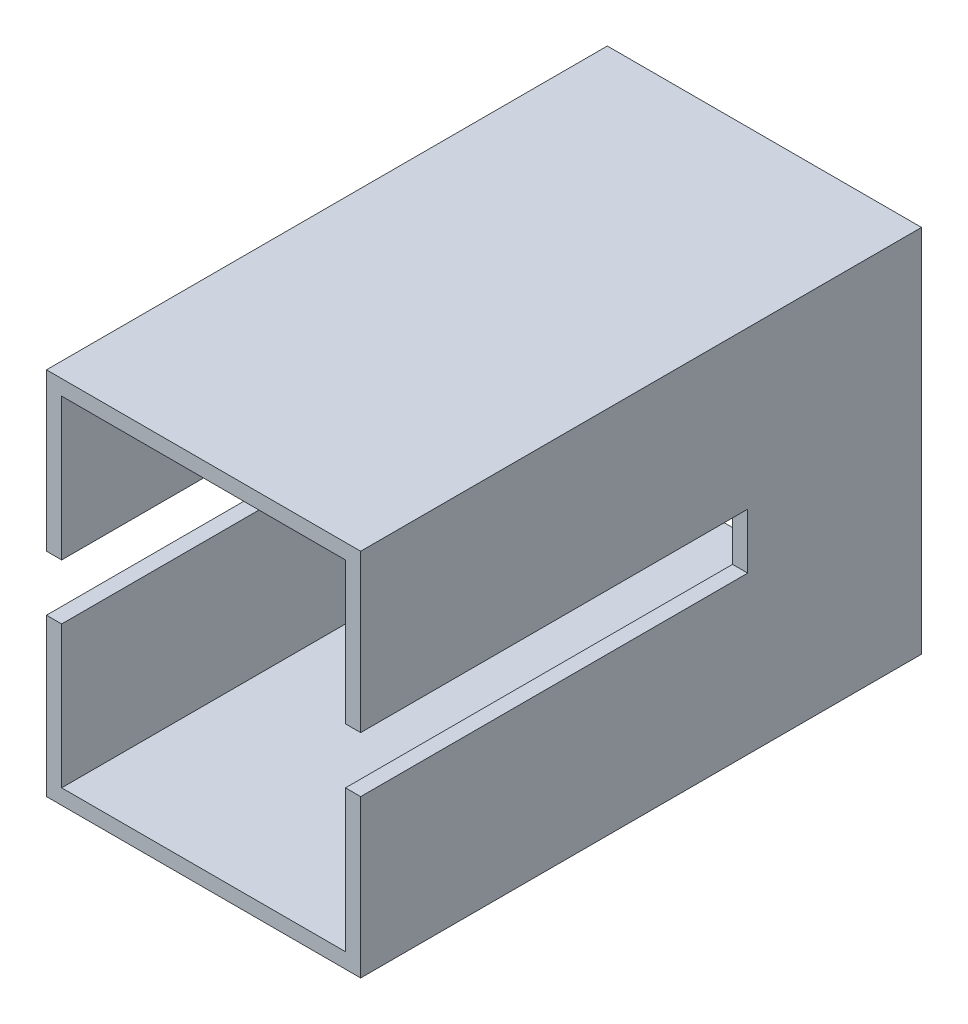
ISO-10303-21;
HEADER;
FILE_DESCRIPTION(('STEP AP214'),'2;1');
FILE_NAME('part.step','',(''),(''),'','','');
FILE_SCHEMA(('AUTOMOTIVE_DESIGN { 1 0 10303 214 1 1 1 1 }'));
ENDSEC;
DATA;
#1=APPLICATION_CONTEXT('core data for automotive mechanical design processes');
#2=APPLICATION_PROTOCOL_DEFINITION('international standard','automotive_design',2000,#1);
#3=PRODUCT_CONTEXT('',#1,'mechanical');
#4=PRODUCT('Part','Part','',(#3));
#5=PRODUCT_RELATED_PRODUCT_CATEGORY('part','',(#4));
#6=PRODUCT_DEFINITION_FORMATION('','',#4);
#7=PRODUCT_DEFINITION_CONTEXT('part definition',#1,'design');
#8=PRODUCT_DEFINITION('design','',#6,#7);
#9=PRODUCT_DEFINITION_SHAPE('','',#8);
#10=(LENGTH_UNIT() NAMED_UNIT(*) SI_UNIT(.MILLI.,.METRE.));
#11=(NAMED_UNIT(*) PLANE_ANGLE_UNIT() SI_UNIT($,.RADIAN.));
#12=(NAMED_UNIT(*) SI_UNIT($,.STERADIAN.) SOLID_ANGLE_UNIT());
#13=UNCERTAINTY_MEASURE_WITH_UNIT(LENGTH_MEASURE(1.E-05),#10,'distance_accuracy_value','');
#14=(GEOMETRIC_REPRESENTATION_CONTEXT(3) GLOBAL_UNCERTAINTY_ASSIGNED_CONTEXT((#13)) GLOBAL_UNIT_ASSIGNED_CONTEXT((#10,
#11,#12)) REPRESENTATION_CONTEXT('',''));
#15=CARTESIAN_POINT('',(0.,0.,0.));
#16=DIRECTION('',(0.,0.,1.));
#17=DIRECTION('',(1.,0.,0.));
#18=AXIS2_PLACEMENT_3D('',#15,#16,#17);
#19=CARTESIAN_POINT('',(0.,0.,36.95));
#20=DIRECTION('',(0.,0.,1.));
#21=DIRECTION('',(1.,0.,0.));
#22=AXIS2_PLACEMENT_3D('',#19,#20,#21);
#23=PLANE('',#22);
#24=DIRECTION('',(-1.,0.,0.));
#25=VECTOR('',#24,1.);
#26=CARTESIAN_POINT('',(10.35,-1.825,36.95));
#27=LINE('',#26,#25);
#28=CARTESIAN_POINT('',(-9.35,-1.825,36.95));
#29=VERTEX_POINT('',#28);
#30=CARTESIAN_POINT('',(-10.35,-1.825,36.95));
#31=VERTEX_POINT('',#30);
#32=EDGE_CURVE('E353',#29,#31,#27,.T.);
#33=ORIENTED_EDGE('',*,*,#32,.T.);
#34=DIRECTION('',(0.,-1.,0.));
#35=VECTOR('',#34,1.);
#36=CARTESIAN_POINT('',(-10.35,11.175,36.95));
#37=LINE('',#36,#35);
#38=CARTESIAN_POINT('',(-10.35,-12.175,36.95));
#39=VERTEX_POINT('',#38);
#40=EDGE_CURVE('E222',#31,#39,#37,.T.);
#41=ORIENTED_EDGE('',*,*,#40,.T.);
#42=DIRECTION('',(1.,0.,0.));
#43=VECTOR('',#42,1.);
#44=CARTESIAN_POINT('',(-9.35,-12.175,36.95));
#45=LINE('',#44,#43);
#46=CARTESIAN_POINT('',(10.35,-12.175,36.95));
#47=VERTEX_POINT('',#46);
#48=EDGE_CURVE('E227',#39,#47,#45,.T.);
#49=ORIENTED_EDGE('',*,*,#48,.T.);
#50=DIRECTION('',(0.,1.,0.));
#51=VECTOR('',#50,1.);
#52=CARTESIAN_POINT('',(10.35,11.175,36.95));
#53=LINE('',#52,#51);
#54=CARTESIAN_POINT('',(10.35,-1.825,36.95));
#55=VERTEX_POINT('',#54);
#56=EDGE_CURVE('E207',#47,#55,#53,.T.);
#57=ORIENTED_EDGE('',*,*,#56,.T.);
#58=CARTESIAN_POINT('',(9.35,-1.825,36.95));
#59=VERTEX_POINT('',#58);
#60=EDGE_CURVE('E285',#55,#59,#27,.T.);
#61=ORIENTED_EDGE('',*,*,#60,.T.);
#62=DIRECTION('',(0.,1.,0.));
#63=VECTOR('',#62,1.);
#64=CARTESIAN_POINT('',(9.35,11.175,36.95));
#65=LINE('',#64,#63);
#66=CARTESIAN_POINT('',(9.35,-11.175,36.95));
#67=VERTEX_POINT('',#66);
#68=EDGE_CURVE('E292',#67,#59,#65,.T.);
#69=ORIENTED_EDGE('',*,*,#68,.F.);
#70=DIRECTION('',(1.,0.,0.));
#71=VECTOR('',#70,1.);
#72=CARTESIAN_POINT('',(-9.35,-11.175,36.95));
#73=LINE('',#72,#71);
#74=CARTESIAN_POINT('',(-9.35,-11.175,36.95));
#75=VERTEX_POINT('',#74);
#76=EDGE_CURVE('E302',#75,#67,#73,.T.);
#77=ORIENTED_EDGE('',*,*,#76,.F.);
#78=DIRECTION('',(0.,-1.,0.));
#79=VECTOR('',#78,1.);
#80=CARTESIAN_POINT('',(-9.35,11.175,36.95));
#81=LINE('',#80,#79);
#82=EDGE_CURVE('E299',#29,#75,#81,.T.);
#83=ORIENTED_EDGE('',*,*,#82,.F.);
#84=EDGE_LOOP('',(#33,#41,#49,#57,#61,#69,#77,#83));
#85=FACE_BOUND('',#84,.T.);
#86=ADVANCED_FACE('F69',(#85),#23,.T.);
#87=DIRECTION('',(-1.,0.,0.));
#88=VECTOR('',#87,1.);
#89=CARTESIAN_POINT('',(10.35,1.825,36.95));
#90=LINE('',#89,#88);
#91=CARTESIAN_POINT('',(10.35,1.825,36.95));
#92=VERTEX_POINT('',#91);
#93=CARTESIAN_POINT('',(9.35,1.825,36.95));
#94=VERTEX_POINT('',#93);
#95=EDGE_CURVE('E85',#92,#94,#90,.T.);
#96=ORIENTED_EDGE('',*,*,#95,.F.);
#97=CARTESIAN_POINT('',(10.35,12.175,36.95));
#98=VERTEX_POINT('',#97);
#99=EDGE_CURVE('E195',#92,#98,#53,.T.);
#100=ORIENTED_EDGE('',*,*,#99,.T.);
#101=DIRECTION('',(-1.,0.,0.));
#102=VECTOR('',#101,1.);
#103=CARTESIAN_POINT('',(-9.35,12.175,36.95));
#104=LINE('',#103,#102);
#105=CARTESIAN_POINT('',(-10.35,12.175,36.95));
#106=VERTEX_POINT('',#105);
#107=EDGE_CURVE('E213',#98,#106,#104,.T.);
#108=ORIENTED_EDGE('',*,*,#107,.T.);
#109=CARTESIAN_POINT('',(-10.35,1.825,36.95));
#110=VERTEX_POINT('',#109);
#111=EDGE_CURVE('E223',#106,#110,#37,.T.);
#112=ORIENTED_EDGE('',*,*,#111,.T.);
#113=CARTESIAN_POINT('',(-9.35,1.825,36.95));
#114=VERTEX_POINT('',#113);
#115=EDGE_CURVE('E200',#114,#110,#90,.T.);
#116=ORIENTED_EDGE('',*,*,#115,.F.);
#117=CARTESIAN_POINT('',(-9.35,11.175,36.95));
#118=VERTEX_POINT('',#117);
#119=EDGE_CURVE('E268',#118,#114,#81,.T.);
#120=ORIENTED_EDGE('',*,*,#119,.F.);
#121=DIRECTION('',(-1.,0.,0.));
#122=VECTOR('',#121,1.);
#123=CARTESIAN_POINT('',(-9.35,11.175,36.95));
#124=LINE('',#123,#122);
#125=CARTESIAN_POINT('',(9.35,11.175,36.95));
#126=VERTEX_POINT('',#125);
#127=EDGE_CURVE('E296',#126,#118,#124,.T.);
#128=ORIENTED_EDGE('',*,*,#127,.F.);
#129=EDGE_CURVE('E198',#94,#126,#65,.T.);
#130=ORIENTED_EDGE('',*,*,#129,.F.);
#131=EDGE_LOOP('',(#96,#100,#108,#112,#116,#120,#128,#130));
#132=FACE_BOUND('',#131,.T.);
#133=ADVANCED_FACE('F194',(#132),#23,.T.);
#134=CARTESIAN_POINT('',(0.,0.,0.));
#135=DIRECTION('',(0.,0.,1.));
#136=DIRECTION('',(1.,0.,0.));
#137=AXIS2_PLACEMENT_3D('',#134,#135,#136);
#138=PLANE('',#137);
#139=DIRECTION('',(0.,1.,0.));
#140=VECTOR('',#139,1.);
#141=CARTESIAN_POINT('',(10.35,11.175,0.));
#142=LINE('',#141,#140);
#143=CARTESIAN_POINT('',(10.35,-12.175,0.));
#144=VERTEX_POINT('',#143);
#145=CARTESIAN_POINT('',(10.35,12.175,0.));
#146=VERTEX_POINT('',#145);
#147=EDGE_CURVE('E231',#144,#146,#142,.T.);
#148=ORIENTED_EDGE('',*,*,#147,.F.);
#149=DIRECTION('',(1.,0.,0.));
#150=VECTOR('',#149,1.);
#151=CARTESIAN_POINT('',(-9.35,-12.175,0.));
#152=LINE('',#151,#150);
#153=CARTESIAN_POINT('',(-10.35,-12.175,0.));
#154=VERTEX_POINT('',#153);
#155=EDGE_CURVE('E208',#154,#144,#152,.T.);
#156=ORIENTED_EDGE('',*,*,#155,.F.);
#157=DIRECTION('',(0.,-1.,0.));
#158=VECTOR('',#157,1.);
#159=CARTESIAN_POINT('',(-10.35,11.175,0.));
#160=LINE('',#159,#158);
#161=CARTESIAN_POINT('',(-10.35,12.175,0.));
#162=VERTEX_POINT('',#161);
#163=EDGE_CURVE('E214',#162,#154,#160,.T.);
#164=ORIENTED_EDGE('',*,*,#163,.F.);
#165=DIRECTION('',(-1.,0.,0.));
#166=VECTOR('',#165,1.);
#167=CARTESIAN_POINT('',(-9.35,12.175,0.));
#168=LINE('',#167,#166);
#169=EDGE_CURVE('E234',#146,#162,#168,.T.);
#170=ORIENTED_EDGE('',*,*,#169,.F.);
#171=EDGE_LOOP('',(#148,#156,#164,#170));
#172=FACE_BOUND('',#171,.T.);
#173=DIRECTION('',(0.,1.,0.));
#174=VECTOR('',#173,1.);
#175=CARTESIAN_POINT('',(9.35,11.175,0.));
#176=LINE('',#175,#174);
#177=CARTESIAN_POINT('',(9.35,-11.175,0.));
#178=VERTEX_POINT('',#177);
#179=CARTESIAN_POINT('',(9.35,11.175,0.));
#180=VERTEX_POINT('',#179);
#181=EDGE_CURVE('E291',#178,#180,#176,.T.);
#182=ORIENTED_EDGE('',*,*,#181,.T.);
#183=DIRECTION('',(-1.,0.,0.));
#184=VECTOR('',#183,1.);
#185=CARTESIAN_POINT('',(-9.35,11.175,0.));
#186=LINE('',#185,#184);
#187=CARTESIAN_POINT('',(-9.35,11.175,0.));
#188=VERTEX_POINT('',#187);
#189=EDGE_CURVE('E309',#180,#188,#186,.T.);
#190=ORIENTED_EDGE('',*,*,#189,.T.);
#191=DIRECTION('',(0.,-1.,0.));
#192=VECTOR('',#191,1.);
#193=CARTESIAN_POINT('',(-9.35,11.175,0.));
#194=LINE('',#193,#192);
#195=CARTESIAN_POINT('',(-9.35,-11.175,0.));
#196=VERTEX_POINT('',#195);
#197=EDGE_CURVE('E313',#188,#196,#194,.T.);
#198=ORIENTED_EDGE('',*,*,#197,.T.);
#199=DIRECTION('',(1.,0.,0.));
#200=VECTOR('',#199,1.);
#201=CARTESIAN_POINT('',(-9.35,-11.175,0.));
#202=LINE('',#201,#200);
#203=EDGE_CURVE('E317',#196,#178,#202,.T.);
#204=ORIENTED_EDGE('',*,*,#203,.T.);
#205=EDGE_LOOP('',(#182,#190,#198,#204));
#206=FACE_BOUND('',#205,.T.);
#207=ADVANCED_FACE('F338',(#172,#206),#138,.F.);
#208=CARTESIAN_POINT('',(10.35,11.175,36.95));
#209=DIRECTION('',(-1.,0.,0.));
#210=DIRECTION('',(0.,-1.,0.));
#211=AXIS2_PLACEMENT_3D('',#208,#209,#210);
#212=PLANE('',#211);
#213=DIRECTION('',(0.,-1.,0.));
#214=VECTOR('',#213,1.);
#215=CARTESIAN_POINT('',(10.35,1.825,11.45));
#216=LINE('',#215,#214);
#217=CARTESIAN_POINT('',(10.35,1.825,11.45));
#218=VERTEX_POINT('',#217);
#219=CARTESIAN_POINT('',(10.35,-1.825,11.45));
#220=VERTEX_POINT('',#219);
#221=EDGE_CURVE('E189',#218,#220,#216,.T.);
#222=ORIENTED_EDGE('',*,*,#221,.T.);
#223=DIRECTION('',(0.,0.,1.));
#224=VECTOR('',#223,1.);
#225=CARTESIAN_POINT('',(10.35,-1.825,11.45));
#226=LINE('',#225,#224);
#227=EDGE_CURVE('E274',#220,#55,#226,.T.);
#228=ORIENTED_EDGE('',*,*,#227,.T.);
#229=ORIENTED_EDGE('',*,*,#56,.F.);
#230=DIRECTION('',(0.,0.,-1.));
#231=VECTOR('',#230,1.);
#232=CARTESIAN_POINT('',(10.35,-12.175,36.95));
#233=LINE('',#232,#231);
#234=EDGE_CURVE('E230',#47,#144,#233,.T.);
#235=ORIENTED_EDGE('',*,*,#234,.T.);
#236=ORIENTED_EDGE('',*,*,#147,.T.);
#237=DIRECTION('',(0.,0.,-1.));
#238=VECTOR('',#237,1.);
#239=CARTESIAN_POINT('',(10.35,12.175,36.95));
#240=LINE('',#239,#238);
#241=EDGE_CURVE('E205',#98,#146,#240,.T.);
#242=ORIENTED_EDGE('',*,*,#241,.F.);
#243=ORIENTED_EDGE('',*,*,#99,.F.);
#244=DIRECTION('',(0.,0.,-1.));
#245=VECTOR('',#244,1.);
#246=CARTESIAN_POINT('',(10.35,1.825,11.45));
#247=LINE('',#246,#245);
#248=EDGE_CURVE('E180',#92,#218,#247,.T.);
#249=ORIENTED_EDGE('',*,*,#248,.T.);
#250=EDGE_LOOP('',(#222,#228,#229,#235,#236,#242,#243,#249));
#251=FACE_BOUND('',#250,.T.);
#252=ADVANCED_FACE('F71',(#251),#212,.F.);
#253=CARTESIAN_POINT('',(-9.35,12.175,36.95));
#254=DIRECTION('',(0.,-1.,0.));
#255=DIRECTION('',(0.,0.,-1.));
#256=AXIS2_PLACEMENT_3D('',#253,#254,#255);
#257=PLANE('',#256);
#258=ORIENTED_EDGE('',*,*,#169,.T.);
#259=DIRECTION('',(0.,0.,-1.));
#260=VECTOR('',#259,1.);
#261=CARTESIAN_POINT('',(-10.35,12.175,36.95));
#262=LINE('',#261,#260);
#263=EDGE_CURVE('E246',#106,#162,#262,.T.);
#264=ORIENTED_EDGE('',*,*,#263,.F.);
#265=ORIENTED_EDGE('',*,*,#107,.F.);
#266=ORIENTED_EDGE('',*,*,#241,.T.);
#267=EDGE_LOOP('',(#258,#264,#265,#266));
#268=FACE_BOUND('',#267,.T.);
#269=ADVANCED_FACE('F395',(#268),#257,.F.);
#270=CARTESIAN_POINT('',(-10.35,11.175,36.95));
#271=DIRECTION('',(1.,0.,0.));
#272=DIRECTION('',(0.,1.,0.));
#273=AXIS2_PLACEMENT_3D('',#270,#271,#272);
#274=PLANE('',#273);
#275=ORIENTED_EDGE('',*,*,#40,.F.);
#276=DIRECTION('',(0.,0.,1.));
#277=VECTOR('',#276,1.);
#278=CARTESIAN_POINT('',(-10.35,-1.825,11.45));
#279=LINE('',#278,#277);
#280=CARTESIAN_POINT('',(-10.35,-1.825,11.45));
#281=VERTEX_POINT('',#280);
#282=EDGE_CURVE('E190',#281,#31,#279,.T.);
#283=ORIENTED_EDGE('',*,*,#282,.F.);
#284=DIRECTION('',(0.,-1.,0.));
#285=VECTOR('',#284,1.);
#286=CARTESIAN_POINT('',(-10.35,1.825,11.45));
#287=LINE('',#286,#285);
#288=CARTESIAN_POINT('',(-10.35,1.825,11.45));
#289=VERTEX_POINT('',#288);
#290=EDGE_CURVE('E415',#289,#281,#287,.T.);
#291=ORIENTED_EDGE('',*,*,#290,.F.);
#292=DIRECTION('',(0.,0.,-1.));
#293=VECTOR('',#292,1.);
#294=CARTESIAN_POINT('',(-10.35,1.825,11.45));
#295=LINE('',#294,#293);
#296=EDGE_CURVE('E413',#110,#289,#295,.T.);
#297=ORIENTED_EDGE('',*,*,#296,.F.);
#298=ORIENTED_EDGE('',*,*,#111,.F.);
#299=ORIENTED_EDGE('',*,*,#263,.T.);
#300=ORIENTED_EDGE('',*,*,#163,.T.);
#301=DIRECTION('',(0.,0.,-1.));
#302=VECTOR('',#301,1.);
#303=CARTESIAN_POINT('',(-10.35,-12.175,36.95));
#304=LINE('',#303,#302);
#305=EDGE_CURVE('E242',#39,#154,#304,.T.);
#306=ORIENTED_EDGE('',*,*,#305,.F.);
#307=EDGE_LOOP('',(#275,#283,#291,#297,#298,#299,#300,#306));
#308=FACE_BOUND('',#307,.T.);
#309=ADVANCED_FACE('F392',(#308),#274,.F.);
#310=CARTESIAN_POINT('',(-9.35,-12.175,36.95));
#311=DIRECTION('',(0.,1.,0.));
#312=DIRECTION('',(0.,0.,1.));
#313=AXIS2_PLACEMENT_3D('',#310,#311,#312);
#314=PLANE('',#313);
#315=ORIENTED_EDGE('',*,*,#155,.T.);
#316=ORIENTED_EDGE('',*,*,#234,.F.);
#317=ORIENTED_EDGE('',*,*,#48,.F.);
#318=ORIENTED_EDGE('',*,*,#305,.T.);
#319=EDGE_LOOP('',(#315,#316,#317,#318));
#320=FACE_BOUND('',#319,.T.);
#321=ADVANCED_FACE('F389',(#320),#314,.F.);
#322=CARTESIAN_POINT('',(9.35,11.175,36.95));
#323=DIRECTION('',(-1.,0.,0.));
#324=DIRECTION('',(0.,-1.,0.));
#325=AXIS2_PLACEMENT_3D('',#322,#323,#324);
#326=PLANE('',#325);
#327=DIRECTION('',(0.,0.,1.));
#328=VECTOR('',#327,1.);
#329=CARTESIAN_POINT('',(9.35,-1.825,36.95));
#330=LINE('',#329,#328);
#331=CARTESIAN_POINT('',(9.35,-1.825,11.45));
#332=VERTEX_POINT('',#331);
#333=EDGE_CURVE('E288',#332,#59,#330,.T.);
#334=ORIENTED_EDGE('',*,*,#333,.F.);
#335=DIRECTION('',(0.,-1.,0.));
#336=VECTOR('',#335,1.);
#337=CARTESIAN_POINT('',(9.35,11.175,11.45));
#338=LINE('',#337,#336);
#339=CARTESIAN_POINT('',(9.35,1.825,11.45));
#340=VERTEX_POINT('',#339);
#341=EDGE_CURVE('E284',#340,#332,#338,.T.);
#342=ORIENTED_EDGE('',*,*,#341,.F.);
#343=DIRECTION('',(0.,0.,-1.));
#344=VECTOR('',#343,1.);
#345=CARTESIAN_POINT('',(9.35,1.825,36.95));
#346=LINE('',#345,#344);
#347=EDGE_CURVE('E281',#94,#340,#346,.T.);
#348=ORIENTED_EDGE('',*,*,#347,.F.);
#349=ORIENTED_EDGE('',*,*,#129,.T.);
#350=DIRECTION('',(0.,0.,-1.));
#351=VECTOR('',#350,1.);
#352=CARTESIAN_POINT('',(9.35,11.175,36.95));
#353=LINE('',#352,#351);
#354=EDGE_CURVE('E218',#126,#180,#353,.T.);
#355=ORIENTED_EDGE('',*,*,#354,.T.);
#356=ORIENTED_EDGE('',*,*,#181,.F.);
#357=DIRECTION('',(0.,0.,-1.));
#358=VECTOR('',#357,1.);
#359=CARTESIAN_POINT('',(9.35,-11.175,36.95));
#360=LINE('',#359,#358);
#361=EDGE_CURVE('E305',#67,#178,#360,.T.);
#362=ORIENTED_EDGE('',*,*,#361,.F.);
#363=ORIENTED_EDGE('',*,*,#68,.T.);
#364=EDGE_LOOP('',(#334,#342,#348,#349,#355,#356,#362,#363));
#365=FACE_BOUND('',#364,.T.);
#366=ADVANCED_FACE('F335',(#365),#326,.T.);
#367=CARTESIAN_POINT('',(-9.35,11.175,36.95));
#368=DIRECTION('',(0.,-1.,0.));
#369=DIRECTION('',(0.,0.,-1.));
#370=AXIS2_PLACEMENT_3D('',#367,#368,#369);
#371=PLANE('',#370);
#372=ORIENTED_EDGE('',*,*,#189,.F.);
#373=ORIENTED_EDGE('',*,*,#354,.F.);
#374=ORIENTED_EDGE('',*,*,#127,.T.);
#375=DIRECTION('',(0.,0.,-1.));
#376=VECTOR('',#375,1.);
#377=CARTESIAN_POINT('',(-9.35,11.175,36.95));
#378=LINE('',#377,#376);
#379=EDGE_CURVE('E326',#118,#188,#378,.T.);
#380=ORIENTED_EDGE('',*,*,#379,.T.);
#381=EDGE_LOOP('',(#372,#373,#374,#380));
#382=FACE_BOUND('',#381,.T.);
#383=ADVANCED_FACE('F441',(#382),#371,.T.);
#384=CARTESIAN_POINT('',(-9.35,11.175,36.95));
#385=DIRECTION('',(1.,0.,0.));
#386=DIRECTION('',(0.,1.,0.));
#387=AXIS2_PLACEMENT_3D('',#384,#385,#386);
#388=PLANE('',#387);
#389=DIRECTION('',(0.,0.,-1.));
#390=VECTOR('',#389,1.);
#391=CARTESIAN_POINT('',(-9.35,-1.825,36.95));
#392=LINE('',#391,#390);
#393=CARTESIAN_POINT('',(-9.35,-1.825,11.45));
#394=VERTEX_POINT('',#393);
#395=EDGE_CURVE('E12',#29,#394,#392,.T.);
#396=ORIENTED_EDGE('',*,*,#395,.F.);
#397=ORIENTED_EDGE('',*,*,#82,.T.);
#398=DIRECTION('',(0.,0.,-1.));
#399=VECTOR('',#398,1.);
#400=CARTESIAN_POINT('',(-9.35,-11.175,36.95));
#401=LINE('',#400,#399);
#402=EDGE_CURVE('E324',#75,#196,#401,.T.);
#403=ORIENTED_EDGE('',*,*,#402,.T.);
#404=ORIENTED_EDGE('',*,*,#197,.F.);
#405=ORIENTED_EDGE('',*,*,#379,.F.);
#406=ORIENTED_EDGE('',*,*,#119,.T.);
#407=DIRECTION('',(0.,0.,1.));
#408=VECTOR('',#407,1.);
#409=CARTESIAN_POINT('',(-9.35,1.825,36.95));
#410=LINE('',#409,#408);
#411=CARTESIAN_POINT('',(-9.35,1.825,11.45));
#412=VERTEX_POINT('',#411);
#413=EDGE_CURVE('E252',#412,#114,#410,.T.);
#414=ORIENTED_EDGE('',*,*,#413,.F.);
#415=DIRECTION('',(0.,1.,0.));
#416=VECTOR('',#415,1.);
#417=CARTESIAN_POINT('',(-9.35,11.175,11.45));
#418=LINE('',#417,#416);
#419=EDGE_CURVE('E78',#394,#412,#418,.T.);
#420=ORIENTED_EDGE('',*,*,#419,.F.);
#421=EDGE_LOOP('',(#396,#397,#403,#404,#405,#406,#414,#420));
#422=FACE_BOUND('',#421,.T.);
#423=ADVANCED_FACE('F265',(#422),#388,.T.);
#424=CARTESIAN_POINT('',(-9.35,-11.175,36.95));
#425=DIRECTION('',(0.,1.,0.));
#426=DIRECTION('',(0.,0.,1.));
#427=AXIS2_PLACEMENT_3D('',#424,#425,#426);
#428=PLANE('',#427);
#429=ORIENTED_EDGE('',*,*,#203,.F.);
#430=ORIENTED_EDGE('',*,*,#402,.F.);
#431=ORIENTED_EDGE('',*,*,#76,.T.);
#432=ORIENTED_EDGE('',*,*,#361,.T.);
#433=EDGE_LOOP('',(#429,#430,#431,#432));
#434=FACE_BOUND('',#433,.T.);
#435=ADVANCED_FACE('F342',(#434),#428,.T.);
#436=CARTESIAN_POINT('',(10.35,1.825,11.45));
#437=DIRECTION('',(0.,1.,0.));
#438=DIRECTION('',(-1.,0.,0.));
#439=AXIS2_PLACEMENT_3D('',#436,#437,#438);
#440=PLANE('',#439);
#441=ORIENTED_EDGE('',*,*,#413,.T.);
#442=ORIENTED_EDGE('',*,*,#115,.T.);
#443=ORIENTED_EDGE('',*,*,#296,.T.);
#444=DIRECTION('',(-1.,0.,0.));
#445=VECTOR('',#444,1.);
#446=CARTESIAN_POINT('',(10.35,1.825,11.45));
#447=LINE('',#446,#445);
#448=EDGE_CURVE('E93',#412,#289,#447,.T.);
#449=ORIENTED_EDGE('',*,*,#448,.F.);
#450=EDGE_LOOP('',(#441,#442,#443,#449));
#451=FACE_BOUND('',#450,.T.);
#452=ADVANCED_FACE('F270',(#451),#440,.F.);
#453=CARTESIAN_POINT('',(10.35,1.825,11.45));
#454=DIRECTION('',(0.,0.,-1.));
#455=DIRECTION('',(-1.,0.,0.));
#456=AXIS2_PLACEMENT_3D('',#453,#454,#455);
#457=PLANE('',#456);
#458=ORIENTED_EDGE('',*,*,#419,.T.);
#459=ORIENTED_EDGE('',*,*,#448,.T.);
#460=ORIENTED_EDGE('',*,*,#290,.T.);
#461=DIRECTION('',(-1.,0.,0.));
#462=VECTOR('',#461,1.);
#463=CARTESIAN_POINT('',(10.35,-1.825,11.45));
#464=LINE('',#463,#462);
#465=EDGE_CURVE('E261',#394,#281,#464,.T.);
#466=ORIENTED_EDGE('',*,*,#465,.F.);
#467=EDGE_LOOP('',(#458,#459,#460,#466));
#468=FACE_BOUND('',#467,.T.);
#469=ADVANCED_FACE('F259',(#468),#457,.F.);
#470=CARTESIAN_POINT('',(10.35,-1.825,11.45));
#471=DIRECTION('',(0.,-1.,0.));
#472=DIRECTION('',(1.,0.,0.));
#473=AXIS2_PLACEMENT_3D('',#470,#471,#472);
#474=PLANE('',#473);
#475=ORIENTED_EDGE('',*,*,#395,.T.);
#476=ORIENTED_EDGE('',*,*,#465,.T.);
#477=ORIENTED_EDGE('',*,*,#282,.T.);
#478=ORIENTED_EDGE('',*,*,#32,.F.);
#479=EDGE_LOOP('',(#475,#476,#477,#478));
#480=FACE_BOUND('',#479,.T.);
#481=ADVANCED_FACE('F370',(#480),#474,.F.);
#482=ORIENTED_EDGE('',*,*,#333,.T.);
#483=ORIENTED_EDGE('',*,*,#60,.F.);
#484=ORIENTED_EDGE('',*,*,#227,.F.);
#485=EDGE_CURVE('E356',#220,#332,#464,.T.);
#486=ORIENTED_EDGE('',*,*,#485,.T.);
#487=EDGE_LOOP('',(#482,#483,#484,#486));
#488=FACE_BOUND('',#487,.T.);
#489=ADVANCED_FACE('F368',(#488),#474,.F.);
#490=ORIENTED_EDGE('',*,*,#341,.T.);
#491=ORIENTED_EDGE('',*,*,#485,.F.);
#492=ORIENTED_EDGE('',*,*,#221,.F.);
#493=EDGE_CURVE('E183',#218,#340,#447,.T.);
#494=ORIENTED_EDGE('',*,*,#493,.T.);
#495=EDGE_LOOP('',(#490,#491,#492,#494));
#496=FACE_BOUND('',#495,.T.);
#497=ADVANCED_FACE('F367',(#496),#457,.F.);
#498=ORIENTED_EDGE('',*,*,#347,.T.);
#499=ORIENTED_EDGE('',*,*,#493,.F.);
#500=ORIENTED_EDGE('',*,*,#248,.F.);
#501=ORIENTED_EDGE('',*,*,#95,.T.);
#502=EDGE_LOOP('',(#498,#499,#500,#501));
#503=FACE_BOUND('',#502,.T.);
#504=ADVANCED_FACE('F181',(#503),#440,.F.);
#505=CLOSED_SHELL('',(#86,#133,#207,#252,#269,#309,#321,#366,#383,#423,#435,#452,#469,#481,#489,
#497,#504));
#506=MANIFOLD_SOLID_BREP('B2',#505);
#507=ADVANCED_BREP_SHAPE_REPRESENTATION('',(#18,#506),#14);
#508=SHAPE_DEFINITION_REPRESENTATION(#9,#507);
ENDSEC;
END-ISO-10303-21;
